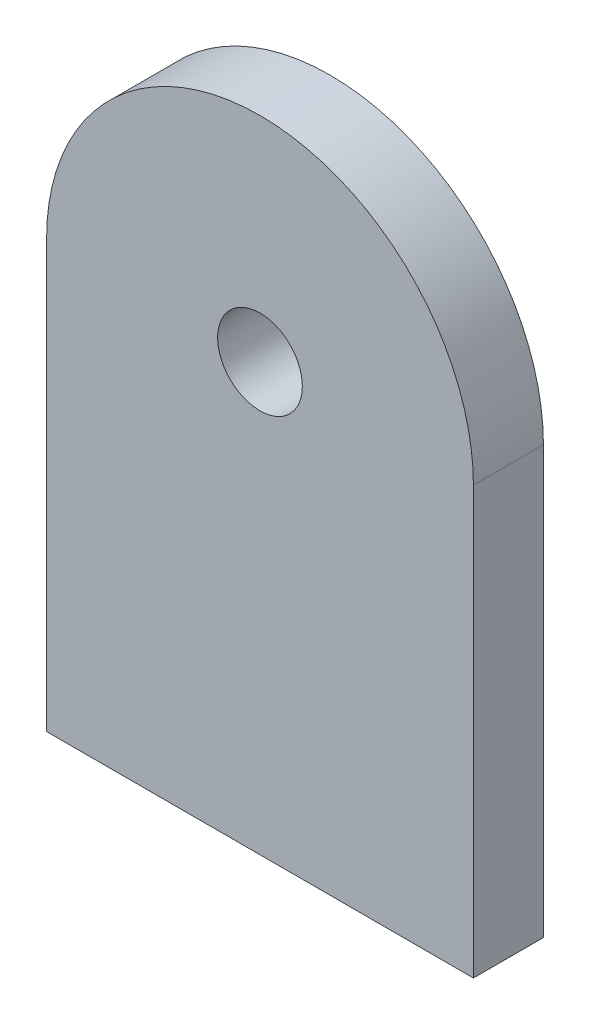
ISO-10303-21;
HEADER;
FILE_DESCRIPTION(('STEP AP214'),'2;1');
FILE_NAME('part.step','',(''),(''),'','','');
FILE_SCHEMA(('AUTOMOTIVE_DESIGN { 1 0 10303 214 1 1 1 1 }'));
ENDSEC;
DATA;
#1=APPLICATION_CONTEXT('core data for automotive mechanical design processes');
#2=APPLICATION_PROTOCOL_DEFINITION('international standard','automotive_design',2000,#1);
#3=PRODUCT_CONTEXT('',#1,'mechanical');
#4=PRODUCT('Part','Part','',(#3));
#5=PRODUCT_RELATED_PRODUCT_CATEGORY('part','',(#4));
#6=PRODUCT_DEFINITION_FORMATION('','',#4);
#7=PRODUCT_DEFINITION_CONTEXT('part definition',#1,'design');
#8=PRODUCT_DEFINITION('design','',#6,#7);
#9=PRODUCT_DEFINITION_SHAPE('','',#8);
#10=(LENGTH_UNIT() NAMED_UNIT(*) SI_UNIT(.MILLI.,.METRE.));
#11=(NAMED_UNIT(*) PLANE_ANGLE_UNIT() SI_UNIT($,.RADIAN.));
#12=(NAMED_UNIT(*) SI_UNIT($,.STERADIAN.) SOLID_ANGLE_UNIT());
#13=UNCERTAINTY_MEASURE_WITH_UNIT(LENGTH_MEASURE(1.E-05),#10,'distance_accuracy_value','');
#14=(GEOMETRIC_REPRESENTATION_CONTEXT(3) GLOBAL_UNCERTAINTY_ASSIGNED_CONTEXT((#13)) GLOBAL_UNIT_ASSIGNED_CONTEXT((#10,
#11,#12)) REPRESENTATION_CONTEXT('',''));
#15=CARTESIAN_POINT('',(0.,0.,0.));
#16=DIRECTION('',(0.,0.,1.));
#17=DIRECTION('',(1.,0.,0.));
#18=AXIS2_PLACEMENT_3D('',#15,#16,#17);
#19=CARTESIAN_POINT('',(0.,0.,2.5));
#20=DIRECTION('',(0.,0.,1.));
#21=DIRECTION('',(1.,0.,0.));
#22=AXIS2_PLACEMENT_3D('',#19,#20,#21);
#23=PLANE('',#22);
#24=CARTESIAN_POINT('',(0.,0.,2.5));
#25=DIRECTION('',(0.,0.,1.));
#26=DIRECTION('',(1.,0.,0.));
#27=AXIS2_PLACEMENT_3D('',#24,#25,#26);
#28=CIRCLE('',#27,15.24);
#29=CARTESIAN_POINT('',(15.24,0.,2.5));
#30=VERTEX_POINT('',#29);
#31=CARTESIAN_POINT('',(-15.24,0.,2.5));
#32=VERTEX_POINT('',#31);
#33=EDGE_CURVE('E84',#30,#32,#28,.T.);
#34=ORIENTED_EDGE('',*,*,#33,.T.);
#35=DIRECTION('',(0.,-1.,0.));
#36=VECTOR('',#35,1.);
#37=CARTESIAN_POINT('',(-15.24,-30.48,2.5));
#38=LINE('',#37,#36);
#39=CARTESIAN_POINT('',(-15.24,-30.48,2.5));
#40=VERTEX_POINT('',#39);
#41=EDGE_CURVE('E79',#32,#40,#38,.T.);
#42=ORIENTED_EDGE('',*,*,#41,.T.);
#43=DIRECTION('',(1.,0.,0.));
#44=VECTOR('',#43,1.);
#45=CARTESIAN_POINT('',(-15.24,-30.48,2.5));
#46=LINE('',#45,#44);
#47=CARTESIAN_POINT('',(15.24,-30.48,2.5));
#48=VERTEX_POINT('',#47);
#49=EDGE_CURVE('E82',#40,#48,#46,.T.);
#50=ORIENTED_EDGE('',*,*,#49,.T.);
#51=DIRECTION('',(0.,1.,0.));
#52=VECTOR('',#51,1.);
#53=CARTESIAN_POINT('',(15.24,-30.48,2.5));
#54=LINE('',#53,#52);
#55=EDGE_CURVE('E49',#48,#30,#54,.T.);
#56=ORIENTED_EDGE('',*,*,#55,.T.);
#57=EDGE_LOOP('',(#34,#42,#50,#56));
#58=FACE_BOUND('',#57,.T.);
#59=CARTESIAN_POINT('',(0.,0.,2.5));
#60=DIRECTION('',(0.,0.,1.));
#61=DIRECTION('',(1.,0.,0.));
#62=AXIS2_PLACEMENT_3D('',#59,#60,#61);
#63=CIRCLE('',#62,3.025);
#64=CARTESIAN_POINT('',(3.025,0.,2.5));
#65=VERTEX_POINT('',#64);
#66=EDGE_CURVE('E99',#65,#65,#63,.T.);
#67=ORIENTED_EDGE('',*,*,#66,.F.);
#68=EDGE_LOOP('',(#67));
#69=FACE_BOUND('',#68,.T.);
#70=ADVANCED_FACE('F32',(#58,#69),#23,.T.);
#71=CARTESIAN_POINT('',(0.,0.,-2.5));
#72=DIRECTION('',(0.,0.,1.));
#73=DIRECTION('',(1.,0.,0.));
#74=AXIS2_PLACEMENT_3D('',#71,#72,#73);
#75=PLANE('',#74);
#76=CARTESIAN_POINT('',(0.,0.,-2.5));
#77=DIRECTION('',(0.,0.,1.));
#78=DIRECTION('',(1.,0.,0.));
#79=AXIS2_PLACEMENT_3D('',#76,#77,#78);
#80=CIRCLE('',#79,15.24);
#81=CARTESIAN_POINT('',(15.24,0.,-2.5));
#82=VERTEX_POINT('',#81);
#83=CARTESIAN_POINT('',(-15.24,0.,-2.5));
#84=VERTEX_POINT('',#83);
#85=EDGE_CURVE('E96',#82,#84,#80,.T.);
#86=ORIENTED_EDGE('',*,*,#85,.F.);
#87=DIRECTION('',(0.,1.,0.));
#88=VECTOR('',#87,1.);
#89=CARTESIAN_POINT('',(15.24,-30.48,-2.5));
#90=LINE('',#89,#88);
#91=CARTESIAN_POINT('',(15.24,-30.48,-2.5));
#92=VERTEX_POINT('',#91);
#93=EDGE_CURVE('E72',#92,#82,#90,.T.);
#94=ORIENTED_EDGE('',*,*,#93,.F.);
#95=DIRECTION('',(1.,0.,0.));
#96=VECTOR('',#95,1.);
#97=CARTESIAN_POINT('',(-15.24,-30.48,-2.5));
#98=LINE('',#97,#96);
#99=CARTESIAN_POINT('',(-15.24,-30.48,-2.5));
#100=VERTEX_POINT('',#99);
#101=EDGE_CURVE('E66',#100,#92,#98,.T.);
#102=ORIENTED_EDGE('',*,*,#101,.F.);
#103=DIRECTION('',(0.,-1.,0.));
#104=VECTOR('',#103,1.);
#105=CARTESIAN_POINT('',(-15.24,-30.48,-2.5));
#106=LINE('',#105,#104);
#107=EDGE_CURVE('E88',#84,#100,#106,.T.);
#108=ORIENTED_EDGE('',*,*,#107,.F.);
#109=EDGE_LOOP('',(#86,#94,#102,#108));
#110=FACE_BOUND('',#109,.T.);
#111=CARTESIAN_POINT('',(0.,0.,-2.5));
#112=DIRECTION('',(0.,0.,1.));
#113=DIRECTION('',(1.,0.,0.));
#114=AXIS2_PLACEMENT_3D('',#111,#112,#113);
#115=CIRCLE('',#114,3.025);
#116=CARTESIAN_POINT('',(3.025,0.,-2.5));
#117=VERTEX_POINT('',#116);
#118=EDGE_CURVE('E111',#117,#117,#115,.T.);
#119=ORIENTED_EDGE('',*,*,#118,.T.);
#120=EDGE_LOOP('',(#119));
#121=FACE_BOUND('',#120,.T.);
#122=ADVANCED_FACE('F107',(#110,#121),#75,.F.);
#123=CARTESIAN_POINT('',(0.,0.,2.5));
#124=DIRECTION('',(0.,0.,-1.));
#125=DIRECTION('',(-1.,0.,0.));
#126=AXIS2_PLACEMENT_3D('',#123,#124,#125);
#127=CYLINDRICAL_SURFACE('',#126,15.24);
#128=ORIENTED_EDGE('',*,*,#85,.T.);
#129=DIRECTION('',(0.,0.,-1.));
#130=VECTOR('',#129,1.);
#131=CARTESIAN_POINT('',(-15.24,0.,2.5));
#132=LINE('',#131,#130);
#133=EDGE_CURVE('E11',#32,#84,#132,.T.);
#134=ORIENTED_EDGE('',*,*,#133,.F.);
#135=ORIENTED_EDGE('',*,*,#33,.F.);
#136=DIRECTION('',(0.,0.,-1.));
#137=VECTOR('',#136,1.);
#138=CARTESIAN_POINT('',(15.24,0.,2.5));
#139=LINE('',#138,#137);
#140=EDGE_CURVE('E92',#30,#82,#139,.T.);
#141=ORIENTED_EDGE('',*,*,#140,.T.);
#142=EDGE_LOOP('',(#128,#134,#135,#141));
#143=FACE_BOUND('',#142,.T.);
#144=ADVANCED_FACE('F34',(#143),#127,.T.);
#145=CARTESIAN_POINT('',(-15.24,-30.48,2.5));
#146=DIRECTION('',(1.,0.,0.));
#147=DIRECTION('',(0.,1.,0.));
#148=AXIS2_PLACEMENT_3D('',#145,#146,#147);
#149=PLANE('',#148);
#150=ORIENTED_EDGE('',*,*,#107,.T.);
#151=DIRECTION('',(0.,0.,-1.));
#152=VECTOR('',#151,1.);
#153=CARTESIAN_POINT('',(-15.24,-30.48,2.5));
#154=LINE('',#153,#152);
#155=EDGE_CURVE('E41',#40,#100,#154,.T.);
#156=ORIENTED_EDGE('',*,*,#155,.F.);
#157=ORIENTED_EDGE('',*,*,#41,.F.);
#158=ORIENTED_EDGE('',*,*,#133,.T.);
#159=EDGE_LOOP('',(#150,#156,#157,#158));
#160=FACE_BOUND('',#159,.T.);
#161=ADVANCED_FACE('F87',(#160),#149,.F.);
#162=CARTESIAN_POINT('',(-15.24,-30.48,2.5));
#163=DIRECTION('',(0.,1.,0.));
#164=DIRECTION('',(-1.,0.,0.));
#165=AXIS2_PLACEMENT_3D('',#162,#163,#164);
#166=PLANE('',#165);
#167=ORIENTED_EDGE('',*,*,#101,.T.);
#168=DIRECTION('',(0.,0.,-1.));
#169=VECTOR('',#168,1.);
#170=CARTESIAN_POINT('',(15.24,-30.48,2.5));
#171=LINE('',#170,#169);
#172=EDGE_CURVE('E89',#48,#92,#171,.T.);
#173=ORIENTED_EDGE('',*,*,#172,.F.);
#174=ORIENTED_EDGE('',*,*,#49,.F.);
#175=ORIENTED_EDGE('',*,*,#155,.T.);
#176=EDGE_LOOP('',(#167,#173,#174,#175));
#177=FACE_BOUND('',#176,.T.);
#178=ADVANCED_FACE('F90',(#177),#166,.F.);
#179=CARTESIAN_POINT('',(15.24,-30.48,2.5));
#180=DIRECTION('',(-1.,0.,0.));
#181=DIRECTION('',(0.,-1.,0.));
#182=AXIS2_PLACEMENT_3D('',#179,#180,#181);
#183=PLANE('',#182);
#184=ORIENTED_EDGE('',*,*,#93,.T.);
#185=ORIENTED_EDGE('',*,*,#140,.F.);
#186=ORIENTED_EDGE('',*,*,#55,.F.);
#187=ORIENTED_EDGE('',*,*,#172,.T.);
#188=EDGE_LOOP('',(#184,#185,#186,#187));
#189=FACE_BOUND('',#188,.T.);
#190=ADVANCED_FACE('F104',(#189),#183,.F.);
#191=CARTESIAN_POINT('',(0.,0.,2.5));
#192=DIRECTION('',(0.,0.,-1.));
#193=DIRECTION('',(-1.,0.,0.));
#194=AXIS2_PLACEMENT_3D('',#191,#192,#193);
#195=CYLINDRICAL_SURFACE('',#194,3.025);
#196=ORIENTED_EDGE('',*,*,#66,.T.);
#197=EDGE_LOOP('',(#196));
#198=FACE_BOUND('',#197,.T.);
#199=ORIENTED_EDGE('',*,*,#118,.F.);
#200=EDGE_LOOP('',(#199));
#201=FACE_BOUND('',#200,.T.);
#202=ADVANCED_FACE('F117',(#198,#201),#195,.F.);
#203=CLOSED_SHELL('',(#70,#122,#144,#161,#178,#190,#202));
#204=MANIFOLD_SOLID_BREP('B2',#203);
#205=ADVANCED_BREP_SHAPE_REPRESENTATION('',(#18,#204),#14);
#206=SHAPE_DEFINITION_REPRESENTATION(#9,#205);
ENDSEC;
END-ISO-10303-21;
